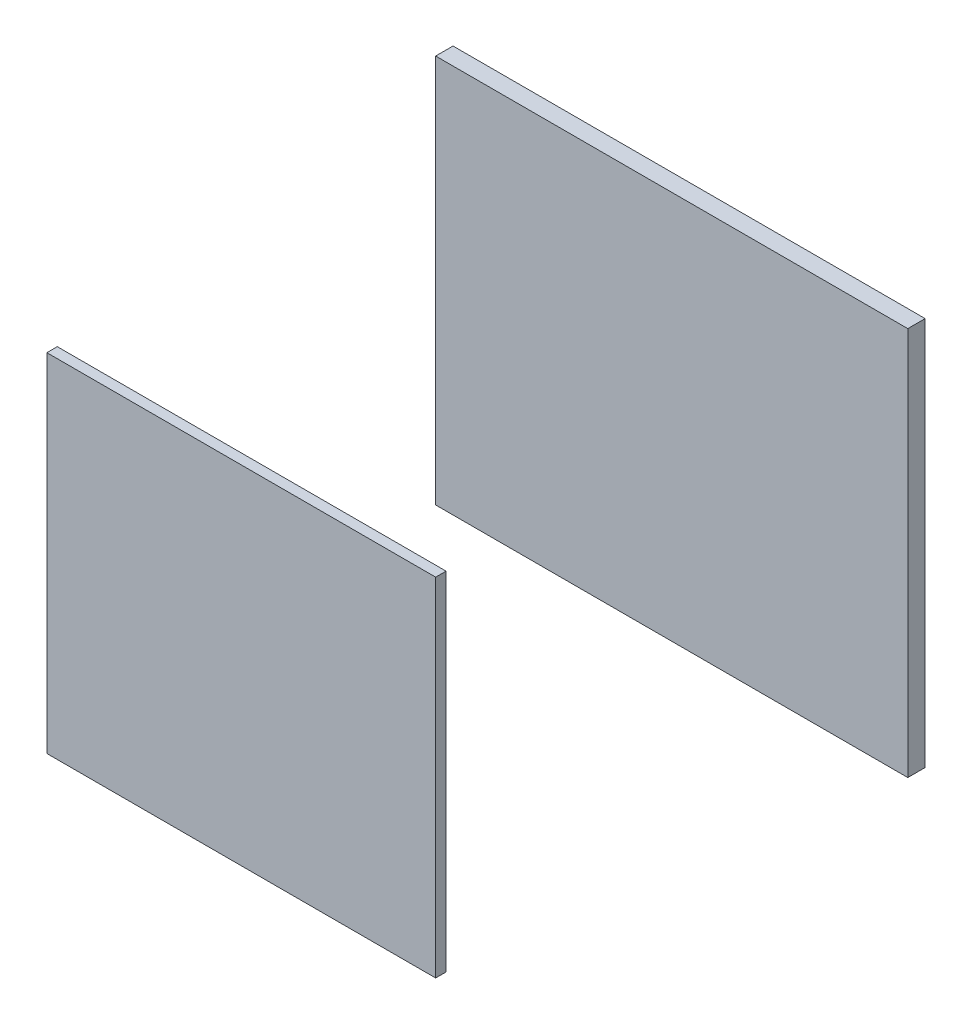
ISO-10303-21;
HEADER;
FILE_DESCRIPTION(('STEP AP214'),'2;1');
FILE_NAME('part.step','',(''),(''),'','','');
FILE_SCHEMA(('AUTOMOTIVE_DESIGN { 1 0 10303 214 1 1 1 1 }'));
ENDSEC;
DATA;
#1=APPLICATION_CONTEXT('core data for automotive mechanical design processes');
#2=APPLICATION_PROTOCOL_DEFINITION('international standard','automotive_design',2000,#1);
#3=PRODUCT_CONTEXT('',#1,'mechanical');
#4=PRODUCT('Part','Part','',(#3));
#5=PRODUCT_RELATED_PRODUCT_CATEGORY('part','',(#4));
#6=PRODUCT_DEFINITION_FORMATION('','',#4);
#7=PRODUCT_DEFINITION_CONTEXT('part definition',#1,'design');
#8=PRODUCT_DEFINITION('design','',#6,#7);
#9=PRODUCT_DEFINITION_SHAPE('','',#8);
#10=(LENGTH_UNIT() NAMED_UNIT(*) SI_UNIT(.MILLI.,.METRE.));
#11=(NAMED_UNIT(*) PLANE_ANGLE_UNIT() SI_UNIT($,.RADIAN.));
#12=(NAMED_UNIT(*) SI_UNIT($,.STERADIAN.) SOLID_ANGLE_UNIT());
#13=UNCERTAINTY_MEASURE_WITH_UNIT(LENGTH_MEASURE(1.E-05),#10,'distance_accuracy_value','');
#14=(GEOMETRIC_REPRESENTATION_CONTEXT(3) GLOBAL_UNCERTAINTY_ASSIGNED_CONTEXT((#13)) GLOBAL_UNIT_ASSIGNED_CONTEXT((#10,
#11,#12)) REPRESENTATION_CONTEXT('',''));
#15=CARTESIAN_POINT('',(0.,0.,0.));
#16=DIRECTION('',(0.,0.,1.));
#17=DIRECTION('',(1.,0.,0.));
#18=AXIS2_PLACEMENT_3D('',#15,#16,#17);
#19=CARTESIAN_POINT('',(-340.,-280.,-645.));
#20=DIRECTION('',(-1.,0.,0.));
#21=DIRECTION('',(0.,0.,1.));
#22=AXIS2_PLACEMENT_3D('',#19,#20,#21);
#23=PLANE('',#22);
#24=DIRECTION('',(0.,0.,1.));
#25=VECTOR('',#24,1.);
#26=CARTESIAN_POINT('',(-340.,-280.,-645.));
#27=LINE('',#26,#25);
#28=CARTESIAN_POINT('',(-340.,-280.,-645.));
#29=VERTEX_POINT('',#28);
#30=CARTESIAN_POINT('',(-340.,-280.,-620.));
#31=VERTEX_POINT('',#30);
#32=EDGE_CURVE('E46',#29,#31,#27,.T.);
#33=ORIENTED_EDGE('',*,*,#32,.T.);
#34=DIRECTION('',(0.,-1.,0.));
#35=VECTOR('',#34,1.);
#36=CARTESIAN_POINT('',(-340.,-280.,-620.));
#37=LINE('',#36,#35);
#38=CARTESIAN_POINT('',(-340.,280.,-620.));
#39=VERTEX_POINT('',#38);
#40=EDGE_CURVE('E83',#39,#31,#37,.T.);
#41=ORIENTED_EDGE('',*,*,#40,.F.);
#42=DIRECTION('',(0.,0.,1.));
#43=VECTOR('',#42,1.);
#44=CARTESIAN_POINT('',(-340.,280.,-645.));
#45=LINE('',#44,#43);
#46=CARTESIAN_POINT('',(-340.,280.,-645.));
#47=VERTEX_POINT('',#46);
#48=EDGE_CURVE('E12',#47,#39,#45,.T.);
#49=ORIENTED_EDGE('',*,*,#48,.F.);
#50=DIRECTION('',(0.,-1.,0.));
#51=VECTOR('',#50,1.);
#52=CARTESIAN_POINT('',(-340.,-280.,-645.));
#53=LINE('',#52,#51);
#54=EDGE_CURVE('E84',#47,#29,#53,.T.);
#55=ORIENTED_EDGE('',*,*,#54,.T.);
#56=EDGE_LOOP('',(#33,#41,#49,#55));
#57=FACE_BOUND('',#56,.T.);
#58=ADVANCED_FACE('F43',(#57),#23,.T.);
#59=CARTESIAN_POINT('',(340.,280.,-645.));
#60=DIRECTION('',(0.,1.,0.));
#61=DIRECTION('',(-1.,0.,0.));
#62=AXIS2_PLACEMENT_3D('',#59,#60,#61);
#63=PLANE('',#62);
#64=ORIENTED_EDGE('',*,*,#48,.T.);
#65=DIRECTION('',(-1.,0.,0.));
#66=VECTOR('',#65,1.);
#67=CARTESIAN_POINT('',(340.,280.,-620.));
#68=LINE('',#67,#66);
#69=CARTESIAN_POINT('',(340.,280.,-620.));
#70=VERTEX_POINT('',#69);
#71=EDGE_CURVE('E100',#70,#39,#68,.T.);
#72=ORIENTED_EDGE('',*,*,#71,.F.);
#73=DIRECTION('',(0.,0.,1.));
#74=VECTOR('',#73,1.);
#75=CARTESIAN_POINT('',(340.,280.,-645.));
#76=LINE('',#75,#74);
#77=CARTESIAN_POINT('',(340.,280.,-645.));
#78=VERTEX_POINT('',#77);
#79=EDGE_CURVE('E51',#78,#70,#76,.T.);
#80=ORIENTED_EDGE('',*,*,#79,.F.);
#81=DIRECTION('',(-1.,0.,0.));
#82=VECTOR('',#81,1.);
#83=CARTESIAN_POINT('',(340.,280.,-645.));
#84=LINE('',#83,#82);
#85=EDGE_CURVE('E89',#78,#47,#84,.T.);
#86=ORIENTED_EDGE('',*,*,#85,.T.);
#87=EDGE_LOOP('',(#64,#72,#80,#86));
#88=FACE_BOUND('',#87,.T.);
#89=ADVANCED_FACE('F115',(#88),#63,.T.);
#90=CARTESIAN_POINT('',(340.,-280.,-645.));
#91=DIRECTION('',(1.,0.,0.));
#92=DIRECTION('',(0.,0.,-1.));
#93=AXIS2_PLACEMENT_3D('',#90,#91,#92);
#94=PLANE('',#93);
#95=ORIENTED_EDGE('',*,*,#79,.T.);
#96=DIRECTION('',(0.,1.,0.));
#97=VECTOR('',#96,1.);
#98=CARTESIAN_POINT('',(340.,-280.,-620.));
#99=LINE('',#98,#97);
#100=CARTESIAN_POINT('',(340.,-280.,-620.));
#101=VERTEX_POINT('',#100);
#102=EDGE_CURVE('E96',#101,#70,#99,.T.);
#103=ORIENTED_EDGE('',*,*,#102,.F.);
#104=DIRECTION('',(0.,0.,1.));
#105=VECTOR('',#104,1.);
#106=CARTESIAN_POINT('',(340.,-280.,-645.));
#107=LINE('',#106,#105);
#108=CARTESIAN_POINT('',(340.,-280.,-645.));
#109=VERTEX_POINT('',#108);
#110=EDGE_CURVE('E88',#109,#101,#107,.T.);
#111=ORIENTED_EDGE('',*,*,#110,.F.);
#112=DIRECTION('',(0.,1.,0.));
#113=VECTOR('',#112,1.);
#114=CARTESIAN_POINT('',(340.,-280.,-645.));
#115=LINE('',#114,#113);
#116=EDGE_CURVE('E108',#109,#78,#115,.T.);
#117=ORIENTED_EDGE('',*,*,#116,.T.);
#118=EDGE_LOOP('',(#95,#103,#111,#117));
#119=FACE_BOUND('',#118,.T.);
#120=ADVANCED_FACE('F112',(#119),#94,.T.);
#121=CARTESIAN_POINT('',(340.,-280.,-645.));
#122=DIRECTION('',(0.,-1.,0.));
#123=DIRECTION('',(1.,0.,0.));
#124=AXIS2_PLACEMENT_3D('',#121,#122,#123);
#125=PLANE('',#124);
#126=ORIENTED_EDGE('',*,*,#110,.T.);
#127=DIRECTION('',(1.,0.,0.));
#128=VECTOR('',#127,1.);
#129=CARTESIAN_POINT('',(340.,-280.,-620.));
#130=LINE('',#129,#128);
#131=EDGE_CURVE('E91',#31,#101,#130,.T.);
#132=ORIENTED_EDGE('',*,*,#131,.F.);
#133=ORIENTED_EDGE('',*,*,#32,.F.);
#134=DIRECTION('',(1.,0.,0.));
#135=VECTOR('',#134,1.);
#136=CARTESIAN_POINT('',(340.,-280.,-645.));
#137=LINE('',#136,#135);
#138=EDGE_CURVE('E106',#29,#109,#137,.T.);
#139=ORIENTED_EDGE('',*,*,#138,.T.);
#140=EDGE_LOOP('',(#126,#132,#133,#139));
#141=FACE_BOUND('',#140,.T.);
#142=ADVANCED_FACE('F92',(#141),#125,.T.);
#143=CARTESIAN_POINT('',(0.,0.,-645.));
#144=DIRECTION('',(0.,0.,1.));
#145=DIRECTION('',(1.,0.,0.));
#146=AXIS2_PLACEMENT_3D('',#143,#144,#145);
#147=PLANE('',#146);
#148=ORIENTED_EDGE('',*,*,#54,.F.);
#149=ORIENTED_EDGE('',*,*,#85,.F.);
#150=ORIENTED_EDGE('',*,*,#116,.F.);
#151=ORIENTED_EDGE('',*,*,#138,.F.);
#152=EDGE_LOOP('',(#148,#149,#150,#151));
#153=FACE_BOUND('',#152,.T.);
#154=ADVANCED_FACE('F117',(#153),#147,.F.);
#155=CARTESIAN_POINT('',(0.,0.,-620.));
#156=DIRECTION('',(0.,0.,1.));
#157=DIRECTION('',(1.,0.,0.));
#158=AXIS2_PLACEMENT_3D('',#155,#156,#157);
#159=PLANE('',#158);
#160=ORIENTED_EDGE('',*,*,#40,.T.);
#161=ORIENTED_EDGE('',*,*,#131,.T.);
#162=ORIENTED_EDGE('',*,*,#102,.T.);
#163=ORIENTED_EDGE('',*,*,#71,.T.);
#164=EDGE_LOOP('',(#160,#161,#162,#163));
#165=FACE_BOUND('',#164,.T.);
#166=ADVANCED_FACE('F99',(#165),#159,.T.);
#167=CLOSED_SHELL('',(#58,#89,#120,#142,#154,#166));
#168=MANIFOLD_SOLID_BREP('B2',#167);
#169=CARTESIAN_POINT('',(-280.,-250.,-15.));
#170=DIRECTION('',(-1.,0.,0.));
#171=DIRECTION('',(0.,0.,1.));
#172=AXIS2_PLACEMENT_3D('',#169,#170,#171);
#173=PLANE('',#172);
#174=DIRECTION('',(0.,-1.,0.));
#175=VECTOR('',#174,1.);
#176=CARTESIAN_POINT('',(-280.,-250.,0.));
#177=LINE('',#176,#175);
#178=CARTESIAN_POINT('',(-280.,250.,0.));
#179=VERTEX_POINT('',#178);
#180=CARTESIAN_POINT('',(-280.,-250.,0.));
#181=VERTEX_POINT('',#180);
#182=EDGE_CURVE('E231',#179,#181,#177,.T.);
#183=ORIENTED_EDGE('',*,*,#182,.F.);
#184=DIRECTION('',(0.,0.,1.));
#185=VECTOR('',#184,1.);
#186=CARTESIAN_POINT('',(-280.,250.,-15.));
#187=LINE('',#186,#185);
#188=CARTESIAN_POINT('',(-280.,250.,-15.));
#189=VERTEX_POINT('',#188);
#190=EDGE_CURVE('E41',#189,#179,#187,.T.);
#191=ORIENTED_EDGE('',*,*,#190,.F.);
#192=DIRECTION('',(0.,-1.,0.));
#193=VECTOR('',#192,1.);
#194=CARTESIAN_POINT('',(-280.,-250.,-15.));
#195=LINE('',#194,#193);
#196=CARTESIAN_POINT('',(-280.,-250.,-15.));
#197=VERTEX_POINT('',#196);
#198=EDGE_CURVE('E225',#189,#197,#195,.T.);
#199=ORIENTED_EDGE('',*,*,#198,.T.);
#200=DIRECTION('',(0.,0.,1.));
#201=VECTOR('',#200,1.);
#202=CARTESIAN_POINT('',(-280.,-250.,-15.));
#203=LINE('',#202,#201);
#204=EDGE_CURVE('E170',#197,#181,#203,.T.);
#205=ORIENTED_EDGE('',*,*,#204,.T.);
#206=EDGE_LOOP('',(#183,#191,#199,#205));
#207=FACE_BOUND('',#206,.T.);
#208=ADVANCED_FACE('F167',(#207),#173,.T.);
#209=CARTESIAN_POINT('',(280.,250.,-15.));
#210=DIRECTION('',(0.,1.,0.));
#211=DIRECTION('',(-1.,0.,0.));
#212=AXIS2_PLACEMENT_3D('',#209,#210,#211);
#213=PLANE('',#212);
#214=DIRECTION('',(-1.,0.,0.));
#215=VECTOR('',#214,1.);
#216=CARTESIAN_POINT('',(280.,250.,0.));
#217=LINE('',#216,#215);
#218=CARTESIAN_POINT('',(280.,250.,0.));
#219=VERTEX_POINT('',#218);
#220=EDGE_CURVE('E227',#219,#179,#217,.T.);
#221=ORIENTED_EDGE('',*,*,#220,.F.);
#222=DIRECTION('',(0.,0.,1.));
#223=VECTOR('',#222,1.);
#224=CARTESIAN_POINT('',(280.,250.,-15.));
#225=LINE('',#224,#223);
#226=CARTESIAN_POINT('',(280.,250.,-15.));
#227=VERTEX_POINT('',#226);
#228=EDGE_CURVE('E176',#227,#219,#225,.T.);
#229=ORIENTED_EDGE('',*,*,#228,.F.);
#230=DIRECTION('',(-1.,0.,0.));
#231=VECTOR('',#230,1.);
#232=CARTESIAN_POINT('',(280.,250.,-15.));
#233=LINE('',#232,#231);
#234=EDGE_CURVE('E222',#227,#189,#233,.T.);
#235=ORIENTED_EDGE('',*,*,#234,.T.);
#236=ORIENTED_EDGE('',*,*,#190,.T.);
#237=EDGE_LOOP('',(#221,#229,#235,#236));
#238=FACE_BOUND('',#237,.T.);
#239=ADVANCED_FACE('F241',(#238),#213,.T.);
#240=CARTESIAN_POINT('',(280.,-250.,-15.));
#241=DIRECTION('',(1.,0.,0.));
#242=DIRECTION('',(0.,0.,-1.));
#243=AXIS2_PLACEMENT_3D('',#240,#241,#242);
#244=PLANE('',#243);
#245=DIRECTION('',(0.,1.,0.));
#246=VECTOR('',#245,1.);
#247=CARTESIAN_POINT('',(280.,-250.,0.));
#248=LINE('',#247,#246);
#249=CARTESIAN_POINT('',(280.,-250.,0.));
#250=VERTEX_POINT('',#249);
#251=EDGE_CURVE('E217',#250,#219,#248,.T.);
#252=ORIENTED_EDGE('',*,*,#251,.F.);
#253=DIRECTION('',(0.,0.,1.));
#254=VECTOR('',#253,1.);
#255=CARTESIAN_POINT('',(280.,-250.,-15.));
#256=LINE('',#255,#254);
#257=CARTESIAN_POINT('',(280.,-250.,-15.));
#258=VERTEX_POINT('',#257);
#259=EDGE_CURVE('E212',#258,#250,#256,.T.);
#260=ORIENTED_EDGE('',*,*,#259,.F.);
#261=DIRECTION('',(0.,1.,0.));
#262=VECTOR('',#261,1.);
#263=CARTESIAN_POINT('',(280.,-250.,-15.));
#264=LINE('',#263,#262);
#265=EDGE_CURVE('E215',#258,#227,#264,.T.);
#266=ORIENTED_EDGE('',*,*,#265,.T.);
#267=ORIENTED_EDGE('',*,*,#228,.T.);
#268=EDGE_LOOP('',(#252,#260,#266,#267));
#269=FACE_BOUND('',#268,.T.);
#270=ADVANCED_FACE('F214',(#269),#244,.T.);
#271=CARTESIAN_POINT('',(280.,-250.,-15.));
#272=DIRECTION('',(0.,-1.,0.));
#273=DIRECTION('',(1.,0.,0.));
#274=AXIS2_PLACEMENT_3D('',#271,#272,#273);
#275=PLANE('',#274);
#276=DIRECTION('',(1.,0.,0.));
#277=VECTOR('',#276,1.);
#278=CARTESIAN_POINT('',(280.,-250.,0.));
#279=LINE('',#278,#277);
#280=EDGE_CURVE('E234',#181,#250,#279,.T.);
#281=ORIENTED_EDGE('',*,*,#280,.F.);
#282=ORIENTED_EDGE('',*,*,#204,.F.);
#283=DIRECTION('',(1.,0.,0.));
#284=VECTOR('',#283,1.);
#285=CARTESIAN_POINT('',(280.,-250.,-15.));
#286=LINE('',#285,#284);
#287=EDGE_CURVE('E221',#197,#258,#286,.T.);
#288=ORIENTED_EDGE('',*,*,#287,.T.);
#289=ORIENTED_EDGE('',*,*,#259,.T.);
#290=EDGE_LOOP('',(#281,#282,#288,#289));
#291=FACE_BOUND('',#290,.T.);
#292=ADVANCED_FACE('F224',(#291),#275,.T.);
#293=CARTESIAN_POINT('',(0.,0.,-15.));
#294=DIRECTION('',(0.,0.,1.));
#295=DIRECTION('',(1.,0.,0.));
#296=AXIS2_PLACEMENT_3D('',#293,#294,#295);
#297=PLANE('',#296);
#298=ORIENTED_EDGE('',*,*,#198,.F.);
#299=ORIENTED_EDGE('',*,*,#234,.F.);
#300=ORIENTED_EDGE('',*,*,#265,.F.);
#301=ORIENTED_EDGE('',*,*,#287,.F.);
#302=EDGE_LOOP('',(#298,#299,#300,#301));
#303=FACE_BOUND('',#302,.T.);
#304=ADVANCED_FACE('F220',(#303),#297,.F.);
#305=CARTESIAN_POINT('',(0.,0.,0.));
#306=DIRECTION('',(0.,0.,1.));
#307=DIRECTION('',(1.,0.,0.));
#308=AXIS2_PLACEMENT_3D('',#305,#306,#307);
#309=PLANE('',#308);
#310=ORIENTED_EDGE('',*,*,#182,.T.);
#311=ORIENTED_EDGE('',*,*,#280,.T.);
#312=ORIENTED_EDGE('',*,*,#251,.T.);
#313=ORIENTED_EDGE('',*,*,#220,.T.);
#314=EDGE_LOOP('',(#310,#311,#312,#313));
#315=FACE_BOUND('',#314,.T.);
#316=ADVANCED_FACE('F240',(#315),#309,.T.);
#317=CLOSED_SHELL('',(#208,#239,#270,#292,#304,#316));
#318=MANIFOLD_SOLID_BREP('B6',#317);
#319=ADVANCED_BREP_SHAPE_REPRESENTATION('',(#18,#168,#318),#14);
#320=SHAPE_DEFINITION_REPRESENTATION(#9,#319);
ENDSEC;
END-ISO-10303-21;
